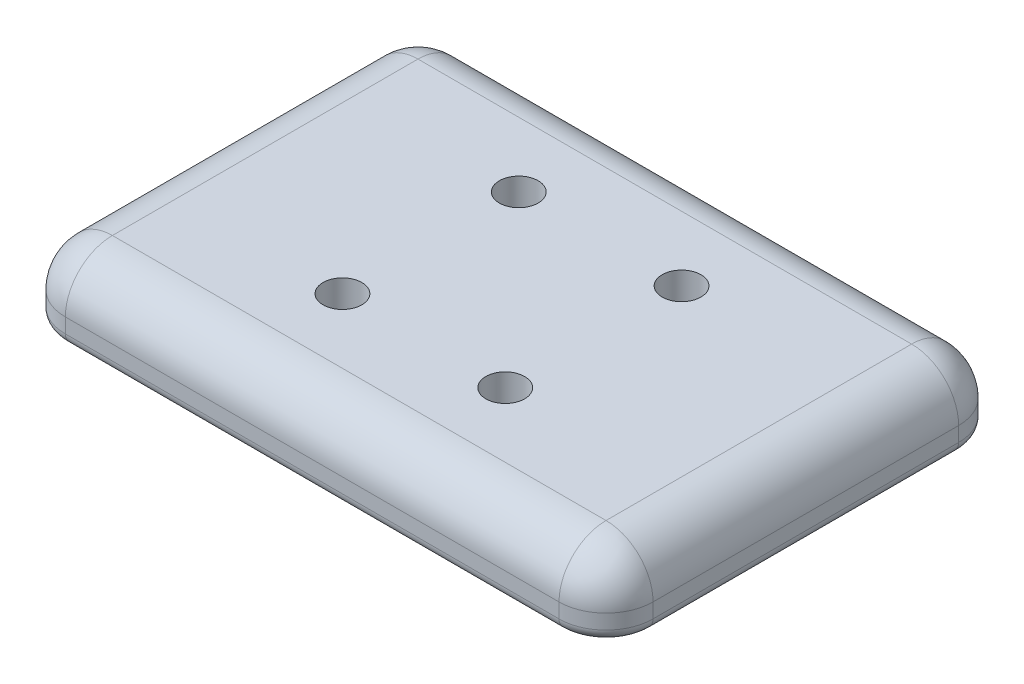
ISO-10303-21;
HEADER;
FILE_DESCRIPTION(('STEP AP214'),'2;1');
FILE_NAME('part.step','',(''),(''),'','','');
FILE_SCHEMA(('AUTOMOTIVE_DESIGN { 1 0 10303 214 1 1 1 1 }'));
ENDSEC;
DATA;
#1=APPLICATION_CONTEXT('core data for automotive mechanical design processes');
#2=APPLICATION_PROTOCOL_DEFINITION('international standard','automotive_design',2000,#1);
#3=PRODUCT_CONTEXT('',#1,'mechanical');
#4=PRODUCT('Part','Part','',(#3));
#5=PRODUCT_RELATED_PRODUCT_CATEGORY('part','',(#4));
#6=PRODUCT_DEFINITION_FORMATION('','',#4);
#7=PRODUCT_DEFINITION_CONTEXT('part definition',#1,'design');
#8=PRODUCT_DEFINITION('design','',#6,#7);
#9=PRODUCT_DEFINITION_SHAPE('','',#8);
#10=(LENGTH_UNIT() NAMED_UNIT(*) SI_UNIT(.MILLI.,.METRE.));
#11=(NAMED_UNIT(*) PLANE_ANGLE_UNIT() SI_UNIT($,.RADIAN.));
#12=(NAMED_UNIT(*) SI_UNIT($,.STERADIAN.) SOLID_ANGLE_UNIT());
#13=UNCERTAINTY_MEASURE_WITH_UNIT(LENGTH_MEASURE(1.E-05),#10,'distance_accuracy_value','');
#14=(GEOMETRIC_REPRESENTATION_CONTEXT(3) GLOBAL_UNCERTAINTY_ASSIGNED_CONTEXT((#13)) GLOBAL_UNIT_ASSIGNED_CONTEXT((#10,
#11,#12)) REPRESENTATION_CONTEXT('',''));
#15=CARTESIAN_POINT('',(0.,0.,0.));
#16=DIRECTION('',(0.,0.,1.));
#17=DIRECTION('',(1.,0.,0.));
#18=AXIS2_PLACEMENT_3D('',#15,#16,#17);
#19=CARTESIAN_POINT('',(0.,0.,68.));
#20=DIRECTION('',(0.,1.,0.));
#21=DIRECTION('',(0.,0.,1.));
#22=AXIS2_PLACEMENT_3D('',#19,#20,#21);
#23=PLANE('',#22);
#24=DIRECTION('',(1.,0.,0.));
#25=VECTOR('',#24,1.);
#26=CARTESIAN_POINT('',(0.,0.,66.));
#27=LINE('',#26,#25);
#28=CARTESIAN_POINT('',(92.,0.,66.));
#29=VERTEX_POINT('',#28);
#30=CARTESIAN_POINT('',(8.00000000000001,0.,66.));
#31=VERTEX_POINT('',#30);
#32=EDGE_CURVE('E202',#29,#31,#27,.F.);
#33=ORIENTED_EDGE('',*,*,#32,.T.);
#34=CARTESIAN_POINT('',(8.00000000000001,0.,60.));
#35=DIRECTION('',(0.,1.,0.));
#36=DIRECTION('',(0.,0.,1.));
#37=AXIS2_PLACEMENT_3D('',#34,#35,#36);
#38=CIRCLE('',#37,6.);
#39=CARTESIAN_POINT('',(2.00000000000001,0.,60.));
#40=VERTEX_POINT('',#39);
#41=EDGE_CURVE('E241',#31,#40,#38,.F.);
#42=ORIENTED_EDGE('',*,*,#41,.T.);
#43=DIRECTION('',(0.,0.,1.));
#44=VECTOR('',#43,1.);
#45=CARTESIAN_POINT('',(2.00000000000001,0.,68.));
#46=LINE('',#45,#44);
#47=CARTESIAN_POINT('',(2.,0.,8.));
#48=VERTEX_POINT('',#47);
#49=EDGE_CURVE('E239',#40,#48,#46,.F.);
#50=ORIENTED_EDGE('',*,*,#49,.T.);
#51=CARTESIAN_POINT('',(8.,0.,8.));
#52=DIRECTION('',(0.,1.,0.));
#53=DIRECTION('',(0.,0.,1.));
#54=AXIS2_PLACEMENT_3D('',#51,#52,#53);
#55=CIRCLE('',#54,6.);
#56=CARTESIAN_POINT('',(8.,0.,2.));
#57=VERTEX_POINT('',#56);
#58=EDGE_CURVE('E237',#48,#57,#55,.F.);
#59=ORIENTED_EDGE('',*,*,#58,.T.);
#60=DIRECTION('',(-1.,0.,0.));
#61=VECTOR('',#60,1.);
#62=CARTESIAN_POINT('',(0.,0.,2.));
#63=LINE('',#62,#61);
#64=CARTESIAN_POINT('',(92.,0.,2.));
#65=VERTEX_POINT('',#64);
#66=EDGE_CURVE('E235',#57,#65,#63,.F.);
#67=ORIENTED_EDGE('',*,*,#66,.T.);
#68=CARTESIAN_POINT('',(92.,0.,8.));
#69=DIRECTION('',(0.,1.,0.));
#70=DIRECTION('',(0.,0.,1.));
#71=AXIS2_PLACEMENT_3D('',#68,#69,#70);
#72=CIRCLE('',#71,6.);
#73=CARTESIAN_POINT('',(98.,0.,8.));
#74=VERTEX_POINT('',#73);
#75=EDGE_CURVE('E233',#65,#74,#72,.F.);
#76=ORIENTED_EDGE('',*,*,#75,.T.);
#77=DIRECTION('',(0.,0.,-1.));
#78=VECTOR('',#77,1.);
#79=CARTESIAN_POINT('',(98.,0.,68.));
#80=LINE('',#79,#78);
#81=CARTESIAN_POINT('',(98.,0.,60.));
#82=VERTEX_POINT('',#81);
#83=EDGE_CURVE('E231',#74,#82,#80,.F.);
#84=ORIENTED_EDGE('',*,*,#83,.T.);
#85=CARTESIAN_POINT('',(92.,0.,60.));
#86=DIRECTION('',(0.,1.,0.));
#87=DIRECTION('',(0.,0.,1.));
#88=AXIS2_PLACEMENT_3D('',#85,#86,#87);
#89=CIRCLE('',#88,6.);
#90=EDGE_CURVE('E229',#82,#29,#89,.F.);
#91=ORIENTED_EDGE('',*,*,#90,.T.);
#92=EDGE_LOOP('',(#33,#42,#50,#59,#67,#76,#84,#91));
#93=FACE_BOUND('',#92,.T.);
#94=CARTESIAN_POINT('',(36.15,0.,19.));
#95=DIRECTION('',(0.,-1.,0.));
#96=DIRECTION('',(0.,0.,-1.));
#97=AXIS2_PLACEMENT_3D('',#94,#95,#96);
#98=CIRCLE('',#97,7.2735);
#99=CARTESIAN_POINT('',(36.15,0.,11.7265));
#100=VERTEX_POINT('',#99);
#101=EDGE_CURVE('E695',#100,#100,#98,.T.);
#102=ORIENTED_EDGE('',*,*,#101,.F.);
#103=EDGE_LOOP('',(#102));
#104=FACE_BOUND('',#103,.T.);
#105=CARTESIAN_POINT('',(63.85,0.,49.));
#106=DIRECTION('',(0.,-1.,0.));
#107=DIRECTION('',(0.,0.,-1.));
#108=AXIS2_PLACEMENT_3D('',#105,#106,#107);
#109=CIRCLE('',#108,7.2735);
#110=CARTESIAN_POINT('',(63.85,0.,41.7265));
#111=VERTEX_POINT('',#110);
#112=EDGE_CURVE('E683',#111,#111,#109,.T.);
#113=ORIENTED_EDGE('',*,*,#112,.F.);
#114=EDGE_LOOP('',(#113));
#115=FACE_BOUND('',#114,.T.);
#116=CARTESIAN_POINT('',(63.85,0.,19.));
#117=DIRECTION('',(0.,-1.,0.));
#118=DIRECTION('',(0.,0.,-1.));
#119=AXIS2_PLACEMENT_3D('',#116,#117,#118);
#120=CIRCLE('',#119,7.2735);
#121=CARTESIAN_POINT('',(63.85,0.,11.7265));
#122=VERTEX_POINT('',#121);
#123=EDGE_CURVE('E669',#122,#122,#120,.T.);
#124=ORIENTED_EDGE('',*,*,#123,.F.);
#125=EDGE_LOOP('',(#124));
#126=FACE_BOUND('',#125,.T.);
#127=CARTESIAN_POINT('',(36.15,0.,49.));
#128=DIRECTION('',(0.,-1.,0.));
#129=DIRECTION('',(0.,0.,-1.));
#130=AXIS2_PLACEMENT_3D('',#127,#128,#129);
#131=CIRCLE('',#130,7.2735);
#132=CARTESIAN_POINT('',(36.15,0.,41.7265));
#133=VERTEX_POINT('',#132);
#134=EDGE_CURVE('E227',#133,#133,#131,.T.);
#135=ORIENTED_EDGE('',*,*,#134,.F.);
#136=EDGE_LOOP('',(#135));
#137=FACE_BOUND('',#136,.T.);
#138=ADVANCED_FACE('F33',(#93,#104,#115,#126,#137),#23,.F.);
#139=CARTESIAN_POINT('',(0.,12.5,0.));
#140=DIRECTION('',(1.,0.,0.));
#141=DIRECTION('',(0.,0.,-1.));
#142=AXIS2_PLACEMENT_3D('',#139,#140,#141);
#143=PLANE('',#142);
#144=DIRECTION('',(0.,-1.,0.));
#145=VECTOR('',#144,1.);
#146=CARTESIAN_POINT('',(0.,12.5,8.));
#147=LINE('',#146,#145);
#148=CARTESIAN_POINT('',(0.,4.5,8.));
#149=VERTEX_POINT('',#148);
#150=CARTESIAN_POINT('',(0.,2.,8.));
#151=VERTEX_POINT('',#150);
#152=EDGE_CURVE('E194',#149,#151,#147,.T.);
#153=ORIENTED_EDGE('',*,*,#152,.T.);
#154=DIRECTION('',(0.,0.,1.));
#155=VECTOR('',#154,1.);
#156=CARTESIAN_POINT('',(0.,2.,0.));
#157=LINE('',#156,#155);
#158=CARTESIAN_POINT('',(0.,2.,60.));
#159=VERTEX_POINT('',#158);
#160=EDGE_CURVE('E247',#151,#159,#157,.T.);
#161=ORIENTED_EDGE('',*,*,#160,.T.);
#162=DIRECTION('',(0.,-1.,0.));
#163=VECTOR('',#162,1.);
#164=CARTESIAN_POINT('',(0.,12.5,60.));
#165=LINE('',#164,#163);
#166=CARTESIAN_POINT('',(0.,4.5,60.));
#167=VERTEX_POINT('',#166);
#168=EDGE_CURVE('E192',#159,#167,#165,.F.);
#169=ORIENTED_EDGE('',*,*,#168,.T.);
#170=DIRECTION('',(0.,0.,1.));
#171=VECTOR('',#170,1.);
#172=CARTESIAN_POINT('',(0.,4.5,0.));
#173=LINE('',#172,#171);
#174=EDGE_CURVE('E190',#167,#149,#173,.F.);
#175=ORIENTED_EDGE('',*,*,#174,.T.);
#176=EDGE_LOOP('',(#153,#161,#169,#175));
#177=FACE_BOUND('',#176,.T.);
#178=ADVANCED_FACE('F315',(#177),#143,.F.);
#179=CARTESIAN_POINT('',(0.,12.5,68.));
#180=DIRECTION('',(0.,0.,-1.));
#181=DIRECTION('',(-1.,0.,0.));
#182=AXIS2_PLACEMENT_3D('',#179,#180,#181);
#183=PLANE('',#182);
#184=DIRECTION('',(0.,-1.,0.));
#185=VECTOR('',#184,1.);
#186=CARTESIAN_POINT('',(8.00000000000001,12.5,68.));
#187=LINE('',#186,#185);
#188=CARTESIAN_POINT('',(8.00000000000001,4.5,68.));
#189=VERTEX_POINT('',#188);
#190=CARTESIAN_POINT('',(8.00000000000001,2.,68.));
#191=VERTEX_POINT('',#190);
#192=EDGE_CURVE('E177',#189,#191,#187,.T.);
#193=ORIENTED_EDGE('',*,*,#192,.T.);
#194=DIRECTION('',(1.,0.,0.));
#195=VECTOR('',#194,1.);
#196=CARTESIAN_POINT('',(0.,2.,68.));
#197=LINE('',#196,#195);
#198=CARTESIAN_POINT('',(92.,2.,68.));
#199=VERTEX_POINT('',#198);
#200=EDGE_CURVE('E11',#191,#199,#197,.T.);
#201=ORIENTED_EDGE('',*,*,#200,.T.);
#202=DIRECTION('',(0.,-1.,0.));
#203=VECTOR('',#202,1.);
#204=CARTESIAN_POINT('',(92.,12.5,68.));
#205=LINE('',#204,#203);
#206=CARTESIAN_POINT('',(92.,4.5,68.));
#207=VERTEX_POINT('',#206);
#208=EDGE_CURVE('E179',#199,#207,#205,.F.);
#209=ORIENTED_EDGE('',*,*,#208,.T.);
#210=DIRECTION('',(1.,0.,0.));
#211=VECTOR('',#210,1.);
#212=CARTESIAN_POINT('',(0.,4.5,68.));
#213=LINE('',#212,#211);
#214=EDGE_CURVE('E172',#207,#189,#213,.F.);
#215=ORIENTED_EDGE('',*,*,#214,.T.);
#216=EDGE_LOOP('',(#193,#201,#209,#215));
#217=FACE_BOUND('',#216,.T.);
#218=ADVANCED_FACE('F321',(#217),#183,.F.);
#219=CARTESIAN_POINT('',(100.,12.5,0.));
#220=DIRECTION('',(-1.,0.,0.));
#221=DIRECTION('',(0.,0.,1.));
#222=AXIS2_PLACEMENT_3D('',#219,#220,#221);
#223=PLANE('',#222);
#224=DIRECTION('',(0.,-1.,0.));
#225=VECTOR('',#224,1.);
#226=CARTESIAN_POINT('',(100.,12.5,60.));
#227=LINE('',#226,#225);
#228=CARTESIAN_POINT('',(100.,4.5,60.));
#229=VERTEX_POINT('',#228);
#230=CARTESIAN_POINT('',(100.,2.,60.));
#231=VERTEX_POINT('',#230);
#232=EDGE_CURVE('E170',#229,#231,#227,.T.);
#233=ORIENTED_EDGE('',*,*,#232,.T.);
#234=DIRECTION('',(0.,0.,-1.));
#235=VECTOR('',#234,1.);
#236=CARTESIAN_POINT('',(100.,2.,0.));
#237=LINE('',#236,#235);
#238=CARTESIAN_POINT('',(100.,2.,8.));
#239=VERTEX_POINT('',#238);
#240=EDGE_CURVE('E141',#231,#239,#237,.T.);
#241=ORIENTED_EDGE('',*,*,#240,.T.);
#242=DIRECTION('',(0.,-1.,0.));
#243=VECTOR('',#242,1.);
#244=CARTESIAN_POINT('',(100.,12.5,8.));
#245=LINE('',#244,#243);
#246=CARTESIAN_POINT('',(100.,4.5,8.));
#247=VERTEX_POINT('',#246);
#248=EDGE_CURVE('E134',#239,#247,#245,.F.);
#249=ORIENTED_EDGE('',*,*,#248,.T.);
#250=DIRECTION('',(0.,0.,-1.));
#251=VECTOR('',#250,1.);
#252=CARTESIAN_POINT('',(100.,4.5,68.));
#253=LINE('',#252,#251);
#254=EDGE_CURVE('E138',#247,#229,#253,.F.);
#255=ORIENTED_EDGE('',*,*,#254,.T.);
#256=EDGE_LOOP('',(#233,#241,#249,#255));
#257=FACE_BOUND('',#256,.T.);
#258=ADVANCED_FACE('F136',(#257),#223,.F.);
#259=CARTESIAN_POINT('',(0.,12.5,0.));
#260=DIRECTION('',(0.,0.,1.));
#261=DIRECTION('',(1.,0.,0.));
#262=AXIS2_PLACEMENT_3D('',#259,#260,#261);
#263=PLANE('',#262);
#264=DIRECTION('',(0.,-1.,0.));
#265=VECTOR('',#264,1.);
#266=CARTESIAN_POINT('',(92.,12.5,0.));
#267=LINE('',#266,#265);
#268=CARTESIAN_POINT('',(92.,4.5,0.));
#269=VERTEX_POINT('',#268);
#270=CARTESIAN_POINT('',(92.,2.,0.));
#271=VERTEX_POINT('',#270);
#272=EDGE_CURVE('E152',#269,#271,#267,.T.);
#273=ORIENTED_EDGE('',*,*,#272,.T.);
#274=DIRECTION('',(-1.,0.,0.));
#275=VECTOR('',#274,1.);
#276=CARTESIAN_POINT('',(0.,2.,0.));
#277=LINE('',#276,#275);
#278=CARTESIAN_POINT('',(8.,2.,0.));
#279=VERTEX_POINT('',#278);
#280=EDGE_CURVE('E251',#271,#279,#277,.T.);
#281=ORIENTED_EDGE('',*,*,#280,.T.);
#282=DIRECTION('',(0.,-1.,0.));
#283=VECTOR('',#282,1.);
#284=CARTESIAN_POINT('',(8.,12.5,0.));
#285=LINE('',#284,#283);
#286=CARTESIAN_POINT('',(8.,4.5,0.));
#287=VERTEX_POINT('',#286);
#288=EDGE_CURVE('E200',#279,#287,#285,.F.);
#289=ORIENTED_EDGE('',*,*,#288,.T.);
#290=DIRECTION('',(-1.,0.,0.));
#291=VECTOR('',#290,1.);
#292=CARTESIAN_POINT('',(100.,4.5,0.));
#293=LINE('',#292,#291);
#294=EDGE_CURVE('E198',#287,#269,#293,.F.);
#295=ORIENTED_EDGE('',*,*,#294,.T.);
#296=EDGE_LOOP('',(#273,#281,#289,#295));
#297=FACE_BOUND('',#296,.T.);
#298=ADVANCED_FACE('F287',(#297),#263,.F.);
#299=CARTESIAN_POINT('',(0.,12.5,68.));
#300=DIRECTION('',(0.,1.,0.));
#301=DIRECTION('',(0.,0.,1.));
#302=AXIS2_PLACEMENT_3D('',#299,#300,#301);
#303=PLANE('',#302);
#304=DIRECTION('',(1.,0.,0.));
#305=VECTOR('',#304,1.);
#306=CARTESIAN_POINT('',(100.,12.5,60.));
#307=LINE('',#306,#305);
#308=CARTESIAN_POINT('',(8.00000000000001,12.5,60.));
#309=VERTEX_POINT('',#308);
#310=CARTESIAN_POINT('',(92.,12.5,60.));
#311=VERTEX_POINT('',#310);
#312=EDGE_CURVE('E183',#309,#311,#307,.T.);
#313=ORIENTED_EDGE('',*,*,#312,.T.);
#314=DIRECTION('',(0.,0.,-1.));
#315=VECTOR('',#314,1.);
#316=CARTESIAN_POINT('',(92.,12.5,0.));
#317=LINE('',#316,#315);
#318=CARTESIAN_POINT('',(92.,12.5,8.));
#319=VERTEX_POINT('',#318);
#320=EDGE_CURVE('E187',#311,#319,#317,.T.);
#321=ORIENTED_EDGE('',*,*,#320,.T.);
#322=DIRECTION('',(-1.,0.,0.));
#323=VECTOR('',#322,1.);
#324=CARTESIAN_POINT('',(0.,12.5,8.));
#325=LINE('',#324,#323);
#326=CARTESIAN_POINT('',(8.,12.5,8.));
#327=VERTEX_POINT('',#326);
#328=EDGE_CURVE('E185',#319,#327,#325,.T.);
#329=ORIENTED_EDGE('',*,*,#328,.T.);
#330=DIRECTION('',(0.,0.,1.));
#331=VECTOR('',#330,1.);
#332=CARTESIAN_POINT('',(8.00000000000001,12.5,68.));
#333=LINE('',#332,#331);
#334=EDGE_CURVE('E181',#327,#309,#333,.T.);
#335=ORIENTED_EDGE('',*,*,#334,.T.);
#336=EDGE_LOOP('',(#313,#321,#329,#335));
#337=FACE_BOUND('',#336,.T.);
#338=CARTESIAN_POINT('',(36.15,12.5,49.));
#339=DIRECTION('',(0.,-1.,0.));
#340=DIRECTION('',(0.,0.,-1.));
#341=AXIS2_PLACEMENT_3D('',#338,#339,#340);
#342=CIRCLE('',#341,3.3);
#343=CARTESIAN_POINT('',(36.15,12.5,45.7));
#344=VERTEX_POINT('',#343);
#345=EDGE_CURVE('E698',#344,#344,#342,.T.);
#346=ORIENTED_EDGE('',*,*,#345,.T.);
#347=EDGE_LOOP('',(#346));
#348=FACE_BOUND('',#347,.T.);
#349=CARTESIAN_POINT('',(36.15,12.5,19.));
#350=DIRECTION('',(0.,-1.,0.));
#351=DIRECTION('',(0.,0.,-1.));
#352=AXIS2_PLACEMENT_3D('',#349,#350,#351);
#353=CIRCLE('',#352,3.3);
#354=CARTESIAN_POINT('',(36.15,12.5,15.7));
#355=VERTEX_POINT('',#354);
#356=EDGE_CURVE('E686',#355,#355,#353,.T.);
#357=ORIENTED_EDGE('',*,*,#356,.T.);
#358=EDGE_LOOP('',(#357));
#359=FACE_BOUND('',#358,.T.);
#360=CARTESIAN_POINT('',(63.85,12.5,49.));
#361=DIRECTION('',(0.,-1.,0.));
#362=DIRECTION('',(0.,0.,-1.));
#363=AXIS2_PLACEMENT_3D('',#360,#361,#362);
#364=CIRCLE('',#363,3.3);
#365=CARTESIAN_POINT('',(63.85,12.5,45.7));
#366=VERTEX_POINT('',#365);
#367=EDGE_CURVE('E674',#366,#366,#364,.T.);
#368=ORIENTED_EDGE('',*,*,#367,.T.);
#369=EDGE_LOOP('',(#368));
#370=FACE_BOUND('',#369,.T.);
#371=CARTESIAN_POINT('',(63.85,12.5,19.));
#372=DIRECTION('',(0.,-1.,0.));
#373=DIRECTION('',(0.,0.,-1.));
#374=AXIS2_PLACEMENT_3D('',#371,#372,#373);
#375=CIRCLE('',#374,3.3);
#376=CARTESIAN_POINT('',(63.85,12.5,15.7));
#377=VERTEX_POINT('',#376);
#378=EDGE_CURVE('E144',#377,#377,#375,.T.);
#379=ORIENTED_EDGE('',*,*,#378,.T.);
#380=EDGE_LOOP('',(#379));
#381=FACE_BOUND('',#380,.T.);
#382=ADVANCED_FACE('F296',(#337,#348,#359,#370,#381),#303,.T.);
#383=CARTESIAN_POINT('',(63.85,0.,19.));
#384=DIRECTION('',(0.,-1.,0.));
#385=DIRECTION('',(0.,0.,-1.));
#386=AXIS2_PLACEMENT_3D('',#383,#384,#385);
#387=CYLINDRICAL_SURFACE('',#386,3.3);
#388=ORIENTED_EDGE('',*,*,#378,.F.);
#389=EDGE_LOOP('',(#388));
#390=FACE_BOUND('',#389,.T.);
#391=CARTESIAN_POINT('',(63.85,6.,19.));
#392=DIRECTION('',(0.,-1.,0.));
#393=DIRECTION('',(0.,0.,-1.));
#394=AXIS2_PLACEMENT_3D('',#391,#392,#393);
#395=CIRCLE('',#394,3.3);
#396=CARTESIAN_POINT('',(63.85,6.,15.7));
#397=VERTEX_POINT('',#396);
#398=EDGE_CURVE('E665',#397,#397,#395,.T.);
#399=ORIENTED_EDGE('',*,*,#398,.T.);
#400=EDGE_LOOP('',(#399));
#401=FACE_BOUND('',#400,.T.);
#402=ADVANCED_FACE('F606',(#390,#401),#387,.F.);
#403=CARTESIAN_POINT('',(67.15,6.,19.));
#404=DIRECTION('',(0.,1.,0.));
#405=DIRECTION('',(0.,0.,1.));
#406=AXIS2_PLACEMENT_3D('',#403,#404,#405);
#407=PLANE('',#406);
#408=ORIENTED_EDGE('',*,*,#398,.F.);
#409=EDGE_LOOP('',(#408));
#410=FACE_BOUND('',#409,.T.);
#411=CARTESIAN_POINT('',(63.85,6.,19.));
#412=DIRECTION('',(0.,-1.,0.));
#413=DIRECTION('',(0.,0.,-1.));
#414=AXIS2_PLACEMENT_3D('',#411,#412,#413);
#415=CIRCLE('',#414,7.2735);
#416=CARTESIAN_POINT('',(63.85,6.,11.7265));
#417=VERTEX_POINT('',#416);
#418=EDGE_CURVE('E666',#417,#417,#415,.T.);
#419=ORIENTED_EDGE('',*,*,#418,.T.);
#420=EDGE_LOOP('',(#419));
#421=FACE_BOUND('',#420,.T.);
#422=ADVANCED_FACE('F597',(#410,#421),#407,.F.);
#423=CARTESIAN_POINT('',(63.85,0.,19.));
#424=DIRECTION('',(0.,-1.,0.));
#425=DIRECTION('',(0.,0.,-1.));
#426=AXIS2_PLACEMENT_3D('',#423,#424,#425);
#427=CYLINDRICAL_SURFACE('',#426,7.2735);
#428=ORIENTED_EDGE('',*,*,#418,.F.);
#429=EDGE_LOOP('',(#428));
#430=FACE_BOUND('',#429,.T.);
#431=ORIENTED_EDGE('',*,*,#123,.T.);
#432=EDGE_LOOP('',(#431));
#433=FACE_BOUND('',#432,.T.);
#434=ADVANCED_FACE('F588',(#430,#433),#427,.F.);
#435=CARTESIAN_POINT('',(63.85,0.,49.));
#436=DIRECTION('',(0.,-1.,0.));
#437=DIRECTION('',(0.,0.,-1.));
#438=AXIS2_PLACEMENT_3D('',#435,#436,#437);
#439=CYLINDRICAL_SURFACE('',#438,3.3);
#440=ORIENTED_EDGE('',*,*,#367,.F.);
#441=EDGE_LOOP('',(#440));
#442=FACE_BOUND('',#441,.T.);
#443=CARTESIAN_POINT('',(63.85,6.,49.));
#444=DIRECTION('',(0.,-1.,0.));
#445=DIRECTION('',(0.,0.,-1.));
#446=AXIS2_PLACEMENT_3D('',#443,#444,#445);
#447=CIRCLE('',#446,3.3);
#448=CARTESIAN_POINT('',(63.85,6.,45.7));
#449=VERTEX_POINT('',#448);
#450=EDGE_CURVE('E677',#449,#449,#447,.T.);
#451=ORIENTED_EDGE('',*,*,#450,.T.);
#452=EDGE_LOOP('',(#451));
#453=FACE_BOUND('',#452,.T.);
#454=ADVANCED_FACE('F579',(#442,#453),#439,.F.);
#455=CARTESIAN_POINT('',(67.15,6.,49.));
#456=DIRECTION('',(0.,1.,0.));
#457=DIRECTION('',(0.,0.,1.));
#458=AXIS2_PLACEMENT_3D('',#455,#456,#457);
#459=PLANE('',#458);
#460=ORIENTED_EDGE('',*,*,#450,.F.);
#461=EDGE_LOOP('',(#460));
#462=FACE_BOUND('',#461,.T.);
#463=CARTESIAN_POINT('',(63.85,6.,49.));
#464=DIRECTION('',(0.,-1.,0.));
#465=DIRECTION('',(0.,0.,-1.));
#466=AXIS2_PLACEMENT_3D('',#463,#464,#465);
#467=CIRCLE('',#466,7.2735);
#468=CARTESIAN_POINT('',(63.85,6.,41.7265));
#469=VERTEX_POINT('',#468);
#470=EDGE_CURVE('E680',#469,#469,#467,.T.);
#471=ORIENTED_EDGE('',*,*,#470,.T.);
#472=EDGE_LOOP('',(#471));
#473=FACE_BOUND('',#472,.T.);
#474=ADVANCED_FACE('F570',(#462,#473),#459,.F.);
#475=CARTESIAN_POINT('',(63.85,0.,49.));
#476=DIRECTION('',(0.,-1.,0.));
#477=DIRECTION('',(0.,0.,-1.));
#478=AXIS2_PLACEMENT_3D('',#475,#476,#477);
#479=CYLINDRICAL_SURFACE('',#478,7.2735);
#480=ORIENTED_EDGE('',*,*,#470,.F.);
#481=EDGE_LOOP('',(#480));
#482=FACE_BOUND('',#481,.T.);
#483=ORIENTED_EDGE('',*,*,#112,.T.);
#484=EDGE_LOOP('',(#483));
#485=FACE_BOUND('',#484,.T.);
#486=ADVANCED_FACE('F561',(#482,#485),#479,.F.);
#487=CARTESIAN_POINT('',(36.15,0.,19.));
#488=DIRECTION('',(0.,-1.,0.));
#489=DIRECTION('',(0.,0.,-1.));
#490=AXIS2_PLACEMENT_3D('',#487,#488,#489);
#491=CYLINDRICAL_SURFACE('',#490,3.3);
#492=ORIENTED_EDGE('',*,*,#356,.F.);
#493=EDGE_LOOP('',(#492));
#494=FACE_BOUND('',#493,.T.);
#495=CARTESIAN_POINT('',(36.15,6.,19.));
#496=DIRECTION('',(0.,-1.,0.));
#497=DIRECTION('',(0.,0.,-1.));
#498=AXIS2_PLACEMENT_3D('',#495,#496,#497);
#499=CIRCLE('',#498,3.3);
#500=CARTESIAN_POINT('',(36.15,6.,15.7));
#501=VERTEX_POINT('',#500);
#502=EDGE_CURVE('E689',#501,#501,#499,.T.);
#503=ORIENTED_EDGE('',*,*,#502,.T.);
#504=EDGE_LOOP('',(#503));
#505=FACE_BOUND('',#504,.T.);
#506=ADVANCED_FACE('F552',(#494,#505),#491,.F.);
#507=CARTESIAN_POINT('',(39.45,6.,19.));
#508=DIRECTION('',(0.,1.,0.));
#509=DIRECTION('',(0.,0.,1.));
#510=AXIS2_PLACEMENT_3D('',#507,#508,#509);
#511=PLANE('',#510);
#512=ORIENTED_EDGE('',*,*,#502,.F.);
#513=EDGE_LOOP('',(#512));
#514=FACE_BOUND('',#513,.T.);
#515=CARTESIAN_POINT('',(36.15,6.,19.));
#516=DIRECTION('',(0.,-1.,0.));
#517=DIRECTION('',(0.,0.,-1.));
#518=AXIS2_PLACEMENT_3D('',#515,#516,#517);
#519=CIRCLE('',#518,7.2735);
#520=CARTESIAN_POINT('',(36.15,6.,11.7265));
#521=VERTEX_POINT('',#520);
#522=EDGE_CURVE('E692',#521,#521,#519,.T.);
#523=ORIENTED_EDGE('',*,*,#522,.T.);
#524=EDGE_LOOP('',(#523));
#525=FACE_BOUND('',#524,.T.);
#526=ADVANCED_FACE('F543',(#514,#525),#511,.F.);
#527=CARTESIAN_POINT('',(36.15,0.,19.));
#528=DIRECTION('',(0.,-1.,0.));
#529=DIRECTION('',(0.,0.,-1.));
#530=AXIS2_PLACEMENT_3D('',#527,#528,#529);
#531=CYLINDRICAL_SURFACE('',#530,7.2735);
#532=ORIENTED_EDGE('',*,*,#522,.F.);
#533=EDGE_LOOP('',(#532));
#534=FACE_BOUND('',#533,.T.);
#535=ORIENTED_EDGE('',*,*,#101,.T.);
#536=EDGE_LOOP('',(#535));
#537=FACE_BOUND('',#536,.T.);
#538=ADVANCED_FACE('F534',(#534,#537),#531,.F.);
#539=CARTESIAN_POINT('',(36.15,0.,49.));
#540=DIRECTION('',(0.,-1.,0.));
#541=DIRECTION('',(0.,0.,-1.));
#542=AXIS2_PLACEMENT_3D('',#539,#540,#541);
#543=CYLINDRICAL_SURFACE('',#542,3.3);
#544=ORIENTED_EDGE('',*,*,#345,.F.);
#545=EDGE_LOOP('',(#544));
#546=FACE_BOUND('',#545,.T.);
#547=CARTESIAN_POINT('',(36.15,6.,49.));
#548=DIRECTION('',(0.,-1.,0.));
#549=DIRECTION('',(0.,0.,-1.));
#550=AXIS2_PLACEMENT_3D('',#547,#548,#549);
#551=CIRCLE('',#550,3.3);
#552=CARTESIAN_POINT('',(36.15,6.,45.7));
#553=VERTEX_POINT('',#552);
#554=EDGE_CURVE('E701',#553,#553,#551,.T.);
#555=ORIENTED_EDGE('',*,*,#554,.T.);
#556=EDGE_LOOP('',(#555));
#557=FACE_BOUND('',#556,.T.);
#558=ADVANCED_FACE('F525',(#546,#557),#543,.F.);
#559=CARTESIAN_POINT('',(39.45,6.,49.));
#560=DIRECTION('',(0.,1.,0.));
#561=DIRECTION('',(0.,0.,1.));
#562=AXIS2_PLACEMENT_3D('',#559,#560,#561);
#563=PLANE('',#562);
#564=ORIENTED_EDGE('',*,*,#554,.F.);
#565=EDGE_LOOP('',(#564));
#566=FACE_BOUND('',#565,.T.);
#567=CARTESIAN_POINT('',(36.15,6.,49.));
#568=DIRECTION('',(0.,-1.,0.));
#569=DIRECTION('',(0.,0.,-1.));
#570=AXIS2_PLACEMENT_3D('',#567,#568,#569);
#571=CIRCLE('',#570,7.2735);
#572=CARTESIAN_POINT('',(36.15,6.,41.7265));
#573=VERTEX_POINT('',#572);
#574=EDGE_CURVE('E704',#573,#573,#571,.T.);
#575=ORIENTED_EDGE('',*,*,#574,.T.);
#576=EDGE_LOOP('',(#575));
#577=FACE_BOUND('',#576,.T.);
#578=ADVANCED_FACE('F516',(#566,#577),#563,.F.);
#579=CARTESIAN_POINT('',(36.15,0.,49.));
#580=DIRECTION('',(0.,-1.,0.));
#581=DIRECTION('',(0.,0.,-1.));
#582=AXIS2_PLACEMENT_3D('',#579,#580,#581);
#583=CYLINDRICAL_SURFACE('',#582,7.2735);
#584=ORIENTED_EDGE('',*,*,#574,.F.);
#585=EDGE_LOOP('',(#584));
#586=FACE_BOUND('',#585,.T.);
#587=ORIENTED_EDGE('',*,*,#134,.T.);
#588=EDGE_LOOP('',(#587));
#589=FACE_BOUND('',#588,.T.);
#590=ADVANCED_FACE('F362',(#586,#589),#583,.F.);
#591=CARTESIAN_POINT('',(8.,12.5,8.));
#592=DIRECTION('',(0.,-1.,0.));
#593=DIRECTION('',(0.,0.,-1.));
#594=AXIS2_PLACEMENT_3D('',#591,#592,#593);
#595=CYLINDRICAL_SURFACE('',#594,8.);
#596=ORIENTED_EDGE('',*,*,#288,.F.);
#597=CARTESIAN_POINT('',(8.,2.,8.));
#598=DIRECTION('',(0.,1.,0.));
#599=DIRECTION('',(0.,0.,1.));
#600=AXIS2_PLACEMENT_3D('',#597,#598,#599);
#601=CIRCLE('',#600,8.);
#602=EDGE_CURVE('E249',#279,#151,#601,.T.);
#603=ORIENTED_EDGE('',*,*,#602,.T.);
#604=ORIENTED_EDGE('',*,*,#152,.F.);
#605=CARTESIAN_POINT('',(8.,4.5,8.));
#606=DIRECTION('',(0.,1.,0.));
#607=DIRECTION('',(0.,0.,1.));
#608=AXIS2_PLACEMENT_3D('',#605,#606,#607);
#609=CIRCLE('',#608,8.);
#610=EDGE_CURVE('E224',#287,#149,#609,.T.);
#611=ORIENTED_EDGE('',*,*,#610,.F.);
#612=EDGE_LOOP('',(#596,#603,#604,#611));
#613=FACE_BOUND('',#612,.T.);
#614=ADVANCED_FACE('F351',(#613),#595,.T.);
#615=CARTESIAN_POINT('',(8.,4.5,8.));
#616=DIRECTION('',(0.,0.,1.));
#617=DIRECTION('',(1.,0.,0.));
#618=AXIS2_PLACEMENT_3D('',#615,#616,#617);
#619=SPHERICAL_SURFACE('',#618,8.);
#620=CARTESIAN_POINT('',(8.,4.5,8.));
#621=DIRECTION('',(-1.,0.,0.));
#622=DIRECTION('',(0.,0.,1.));
#623=AXIS2_PLACEMENT_3D('',#620,#621,#622);
#624=CIRCLE('',#623,8.);
#625=EDGE_CURVE('E218',#287,#327,#624,.F.);
#626=ORIENTED_EDGE('',*,*,#625,.F.);
#627=ORIENTED_EDGE('',*,*,#610,.T.);
#628=CARTESIAN_POINT('',(8.,4.5,8.));
#629=DIRECTION('',(0.,0.,-1.));
#630=DIRECTION('',(-1.,0.,0.));
#631=AXIS2_PLACEMENT_3D('',#628,#629,#630);
#632=CIRCLE('',#631,8.);
#633=EDGE_CURVE('E221',#327,#149,#632,.F.);
#634=ORIENTED_EDGE('',*,*,#633,.F.);
#635=EDGE_LOOP('',(#626,#627,#634));
#636=FACE_BOUND('',#635,.T.);
#637=ADVANCED_FACE('F354',(#636),#619,.T.);
#638=CARTESIAN_POINT('',(8.00000000000001,12.5,60.));
#639=DIRECTION('',(0.,-1.,0.));
#640=DIRECTION('',(0.,0.,-1.));
#641=AXIS2_PLACEMENT_3D('',#638,#639,#640);
#642=CYLINDRICAL_SURFACE('',#641,8.);
#643=ORIENTED_EDGE('',*,*,#168,.F.);
#644=CARTESIAN_POINT('',(8.00000000000001,2.,60.));
#645=DIRECTION('',(0.,1.,0.));
#646=DIRECTION('',(0.,0.,1.));
#647=AXIS2_PLACEMENT_3D('',#644,#645,#646);
#648=CIRCLE('',#647,8.);
#649=EDGE_CURVE('E244',#159,#191,#648,.T.);
#650=ORIENTED_EDGE('',*,*,#649,.T.);
#651=ORIENTED_EDGE('',*,*,#192,.F.);
#652=CARTESIAN_POINT('',(8.00000000000001,4.5,60.));
#653=DIRECTION('',(0.,1.,0.));
#654=DIRECTION('',(0.,0.,1.));
#655=AXIS2_PLACEMENT_3D('',#652,#653,#654);
#656=CIRCLE('',#655,8.);
#657=EDGE_CURVE('E215',#167,#189,#656,.T.);
#658=ORIENTED_EDGE('',*,*,#657,.F.);
#659=EDGE_LOOP('',(#643,#650,#651,#658));
#660=FACE_BOUND('',#659,.T.);
#661=ADVANCED_FACE('F338',(#660),#642,.T.);
#662=CARTESIAN_POINT('',(8.00000000000001,4.5,68.));
#663=DIRECTION('',(0.,0.,-1.));
#664=DIRECTION('',(-1.,0.,0.));
#665=AXIS2_PLACEMENT_3D('',#662,#663,#664);
#666=CYLINDRICAL_SURFACE('',#665,8.);
#667=ORIENTED_EDGE('',*,*,#633,.T.);
#668=ORIENTED_EDGE('',*,*,#174,.F.);
#669=CARTESIAN_POINT('',(8.00000000000001,4.5,60.));
#670=DIRECTION('',(0.,0.,1.));
#671=DIRECTION('',(1.,0.,0.));
#672=AXIS2_PLACEMENT_3D('',#669,#670,#671);
#673=CIRCLE('',#672,8.);
#674=EDGE_CURVE('E212',#309,#167,#673,.T.);
#675=ORIENTED_EDGE('',*,*,#674,.F.);
#676=ORIENTED_EDGE('',*,*,#334,.F.);
#677=EDGE_LOOP('',(#667,#668,#675,#676));
#678=FACE_BOUND('',#677,.T.);
#679=ADVANCED_FACE('F347',(#678),#666,.T.);
#680=CARTESIAN_POINT('',(0.,4.5,8.));
#681=DIRECTION('',(1.,0.,0.));
#682=DIRECTION('',(0.,0.,-1.));
#683=AXIS2_PLACEMENT_3D('',#680,#681,#682);
#684=CYLINDRICAL_SURFACE('',#683,8.);
#685=ORIENTED_EDGE('',*,*,#625,.T.);
#686=ORIENTED_EDGE('',*,*,#328,.F.);
#687=CARTESIAN_POINT('',(92.,4.5,8.));
#688=DIRECTION('',(1.,0.,0.));
#689=DIRECTION('',(0.,0.,-1.));
#690=AXIS2_PLACEMENT_3D('',#687,#688,#689);
#691=CIRCLE('',#690,8.);
#692=EDGE_CURVE('E156',#269,#319,#691,.T.);
#693=ORIENTED_EDGE('',*,*,#692,.F.);
#694=ORIENTED_EDGE('',*,*,#294,.F.);
#695=EDGE_LOOP('',(#685,#686,#693,#694));
#696=FACE_BOUND('',#695,.T.);
#697=ADVANCED_FACE('F292',(#696),#684,.T.);
#698=CARTESIAN_POINT('',(92.,12.5,8.));
#699=DIRECTION('',(0.,-1.,0.));
#700=DIRECTION('',(0.,0.,-1.));
#701=AXIS2_PLACEMENT_3D('',#698,#699,#700);
#702=CYLINDRICAL_SURFACE('',#701,8.);
#703=ORIENTED_EDGE('',*,*,#248,.F.);
#704=CARTESIAN_POINT('',(92.,2.,8.));
#705=DIRECTION('',(0.,1.,0.));
#706=DIRECTION('',(0.,0.,1.));
#707=AXIS2_PLACEMENT_3D('',#704,#705,#706);
#708=CIRCLE('',#707,8.);
#709=EDGE_CURVE('E253',#239,#271,#708,.T.);
#710=ORIENTED_EDGE('',*,*,#709,.T.);
#711=ORIENTED_EDGE('',*,*,#272,.F.);
#712=CARTESIAN_POINT('',(92.,4.5,8.));
#713=DIRECTION('',(0.,1.,0.));
#714=DIRECTION('',(0.,0.,1.));
#715=AXIS2_PLACEMENT_3D('',#712,#713,#714);
#716=CIRCLE('',#715,8.);
#717=EDGE_CURVE('E148',#247,#269,#716,.T.);
#718=ORIENTED_EDGE('',*,*,#717,.F.);
#719=EDGE_LOOP('',(#703,#710,#711,#718));
#720=FACE_BOUND('',#719,.T.);
#721=ADVANCED_FACE('F150',(#720),#702,.T.);
#722=CARTESIAN_POINT('',(8.00000000000001,4.5,60.));
#723=DIRECTION('',(0.,0.,1.));
#724=DIRECTION('',(1.,0.,0.));
#725=AXIS2_PLACEMENT_3D('',#722,#723,#724);
#726=SPHERICAL_SURFACE('',#725,8.);
#727=ORIENTED_EDGE('',*,*,#674,.T.);
#728=ORIENTED_EDGE('',*,*,#657,.T.);
#729=CARTESIAN_POINT('',(8.00000000000001,4.5,60.));
#730=DIRECTION('',(-1.,0.,0.));
#731=DIRECTION('',(0.,0.,1.));
#732=AXIS2_PLACEMENT_3D('',#729,#730,#731);
#733=CIRCLE('',#732,8.);
#734=EDGE_CURVE('E157',#309,#189,#733,.F.);
#735=ORIENTED_EDGE('',*,*,#734,.F.);
#736=EDGE_LOOP('',(#727,#728,#735));
#737=FACE_BOUND('',#736,.T.);
#738=ADVANCED_FACE('F342',(#737),#726,.T.);
#739=CARTESIAN_POINT('',(92.,4.5,8.));
#740=DIRECTION('',(0.,0.,1.));
#741=DIRECTION('',(1.,0.,0.));
#742=AXIS2_PLACEMENT_3D('',#739,#740,#741);
#743=SPHERICAL_SURFACE('',#742,8.);
#744=ORIENTED_EDGE('',*,*,#717,.T.);
#745=ORIENTED_EDGE('',*,*,#692,.T.);
#746=CARTESIAN_POINT('',(92.,4.5,8.));
#747=DIRECTION('',(0.,0.,-1.));
#748=DIRECTION('',(-1.,0.,0.));
#749=AXIS2_PLACEMENT_3D('',#746,#747,#748);
#750=CIRCLE('',#749,8.);
#751=EDGE_CURVE('E159',#247,#319,#750,.F.);
#752=ORIENTED_EDGE('',*,*,#751,.F.);
#753=EDGE_LOOP('',(#744,#745,#752));
#754=FACE_BOUND('',#753,.T.);
#755=ADVANCED_FACE('F160',(#754),#743,.T.);
#756=CARTESIAN_POINT('',(0.,4.5,60.));
#757=DIRECTION('',(-1.,0.,0.));
#758=DIRECTION('',(0.,0.,1.));
#759=AXIS2_PLACEMENT_3D('',#756,#757,#758);
#760=CYLINDRICAL_SURFACE('',#759,8.);
#761=ORIENTED_EDGE('',*,*,#734,.T.);
#762=ORIENTED_EDGE('',*,*,#214,.F.);
#763=CARTESIAN_POINT('',(92.,4.5,60.));
#764=DIRECTION('',(1.,0.,0.));
#765=DIRECTION('',(0.,0.,-1.));
#766=AXIS2_PLACEMENT_3D('',#763,#764,#765);
#767=CIRCLE('',#766,8.);
#768=EDGE_CURVE('E164',#311,#207,#767,.T.);
#769=ORIENTED_EDGE('',*,*,#768,.F.);
#770=ORIENTED_EDGE('',*,*,#312,.F.);
#771=EDGE_LOOP('',(#761,#762,#769,#770));
#772=FACE_BOUND('',#771,.T.);
#773=ADVANCED_FACE('F302',(#772),#760,.T.);
#774=CARTESIAN_POINT('',(92.,4.5,68.));
#775=DIRECTION('',(0.,0.,1.));
#776=DIRECTION('',(1.,0.,0.));
#777=AXIS2_PLACEMENT_3D('',#774,#775,#776);
#778=CYLINDRICAL_SURFACE('',#777,8.);
#779=ORIENTED_EDGE('',*,*,#751,.T.);
#780=ORIENTED_EDGE('',*,*,#320,.F.);
#781=CARTESIAN_POINT('',(92.,4.5,60.));
#782=DIRECTION('',(0.,0.,1.));
#783=DIRECTION('',(1.,0.,0.));
#784=AXIS2_PLACEMENT_3D('',#781,#782,#783);
#785=CIRCLE('',#784,8.);
#786=EDGE_CURVE('E168',#229,#311,#785,.T.);
#787=ORIENTED_EDGE('',*,*,#786,.F.);
#788=ORIENTED_EDGE('',*,*,#254,.F.);
#789=EDGE_LOOP('',(#779,#780,#787,#788));
#790=FACE_BOUND('',#789,.T.);
#791=ADVANCED_FACE('F166',(#790),#778,.T.);
#792=CARTESIAN_POINT('',(92.,4.5,60.));
#793=DIRECTION('',(0.,0.,1.));
#794=DIRECTION('',(1.,0.,0.));
#795=AXIS2_PLACEMENT_3D('',#792,#793,#794);
#796=SPHERICAL_SURFACE('',#795,8.);
#797=ORIENTED_EDGE('',*,*,#786,.T.);
#798=ORIENTED_EDGE('',*,*,#768,.T.);
#799=CARTESIAN_POINT('',(92.,4.5,60.));
#800=DIRECTION('',(0.,1.,0.));
#801=DIRECTION('',(0.,0.,1.));
#802=AXIS2_PLACEMENT_3D('',#799,#800,#801);
#803=CIRCLE('',#802,8.);
#804=EDGE_CURVE('E203',#229,#207,#803,.F.);
#805=ORIENTED_EDGE('',*,*,#804,.F.);
#806=EDGE_LOOP('',(#797,#798,#805));
#807=FACE_BOUND('',#806,.T.);
#808=ADVANCED_FACE('F304',(#807),#796,.T.);
#809=CARTESIAN_POINT('',(92.,12.5,60.));
#810=DIRECTION('',(0.,-1.,0.));
#811=DIRECTION('',(0.,0.,-1.));
#812=AXIS2_PLACEMENT_3D('',#809,#810,#811);
#813=CYLINDRICAL_SURFACE('',#812,8.);
#814=ORIENTED_EDGE('',*,*,#208,.F.);
#815=CARTESIAN_POINT('',(92.,2.,60.));
#816=DIRECTION('',(0.,1.,0.));
#817=DIRECTION('',(0.,0.,1.));
#818=AXIS2_PLACEMENT_3D('',#815,#816,#817);
#819=CIRCLE('',#818,8.);
#820=EDGE_CURVE('E42',#199,#231,#819,.T.);
#821=ORIENTED_EDGE('',*,*,#820,.T.);
#822=ORIENTED_EDGE('',*,*,#232,.F.);
#823=ORIENTED_EDGE('',*,*,#804,.T.);
#824=EDGE_LOOP('',(#814,#821,#822,#823));
#825=FACE_BOUND('',#824,.T.);
#826=ADVANCED_FACE('F305',(#825),#813,.T.);
#827=CARTESIAN_POINT('',(92.,2.,8.));
#828=DIRECTION('',(0.,1.,0.));
#829=DIRECTION('',(0.,0.,1.));
#830=AXIS2_PLACEMENT_3D('',#827,#828,#829);
#831=TOROIDAL_SURFACE('',#830,6.,2.);
#832=CARTESIAN_POINT('',(92.,2.,2.));
#833=DIRECTION('',(-1.,0.,0.));
#834=DIRECTION('',(0.,0.,1.));
#835=AXIS2_PLACEMENT_3D('',#832,#833,#834);
#836=CIRCLE('',#835,2.);
#837=EDGE_CURVE('E272',#271,#65,#836,.T.);
#838=ORIENTED_EDGE('',*,*,#837,.F.);
#839=ORIENTED_EDGE('',*,*,#709,.F.);
#840=CARTESIAN_POINT('',(98.,2.,8.));
#841=DIRECTION('',(0.,0.,1.));
#842=DIRECTION('',(1.,0.,0.));
#843=AXIS2_PLACEMENT_3D('',#840,#841,#842);
#844=CIRCLE('',#843,2.);
#845=EDGE_CURVE('E37',#74,#239,#844,.T.);
#846=ORIENTED_EDGE('',*,*,#845,.F.);
#847=ORIENTED_EDGE('',*,*,#75,.F.);
#848=EDGE_LOOP('',(#838,#839,#846,#847));
#849=FACE_BOUND('',#848,.T.);
#850=ADVANCED_FACE('F35',(#849),#831,.T.);
#851=CARTESIAN_POINT('',(98.,2.,0.));
#852=DIRECTION('',(0.,0.,-1.));
#853=DIRECTION('',(-1.,0.,0.));
#854=AXIS2_PLACEMENT_3D('',#851,#852,#853);
#855=CYLINDRICAL_SURFACE('',#854,2.);
#856=ORIENTED_EDGE('',*,*,#845,.T.);
#857=ORIENTED_EDGE('',*,*,#240,.F.);
#858=CARTESIAN_POINT('',(98.,2.,60.));
#859=DIRECTION('',(0.,0.,1.));
#860=DIRECTION('',(1.,0.,0.));
#861=AXIS2_PLACEMENT_3D('',#858,#859,#860);
#862=CIRCLE('',#861,2.);
#863=EDGE_CURVE('E270',#82,#231,#862,.T.);
#864=ORIENTED_EDGE('',*,*,#863,.F.);
#865=ORIENTED_EDGE('',*,*,#83,.F.);
#866=EDGE_LOOP('',(#856,#857,#864,#865));
#867=FACE_BOUND('',#866,.T.);
#868=ADVANCED_FACE('F282',(#867),#855,.T.);
#869=CARTESIAN_POINT('',(0.,2.,2.));
#870=DIRECTION('',(-1.,0.,0.));
#871=DIRECTION('',(0.,0.,1.));
#872=AXIS2_PLACEMENT_3D('',#869,#870,#871);
#873=CYLINDRICAL_SURFACE('',#872,2.);
#874=ORIENTED_EDGE('',*,*,#837,.T.);
#875=ORIENTED_EDGE('',*,*,#66,.F.);
#876=CARTESIAN_POINT('',(8.,2.,2.));
#877=DIRECTION('',(-1.,0.,0.));
#878=DIRECTION('',(0.,0.,1.));
#879=AXIS2_PLACEMENT_3D('',#876,#877,#878);
#880=CIRCLE('',#879,2.);
#881=EDGE_CURVE('E267',#279,#57,#880,.T.);
#882=ORIENTED_EDGE('',*,*,#881,.F.);
#883=ORIENTED_EDGE('',*,*,#280,.F.);
#884=EDGE_LOOP('',(#874,#875,#882,#883));
#885=FACE_BOUND('',#884,.T.);
#886=ADVANCED_FACE('F385',(#885),#873,.T.);
#887=CARTESIAN_POINT('',(92.,2.,60.));
#888=DIRECTION('',(0.,1.,0.));
#889=DIRECTION('',(0.,0.,1.));
#890=AXIS2_PLACEMENT_3D('',#887,#888,#889);
#891=TOROIDAL_SURFACE('',#890,6.,2.);
#892=ORIENTED_EDGE('',*,*,#863,.T.);
#893=ORIENTED_EDGE('',*,*,#820,.F.);
#894=CARTESIAN_POINT('',(92.,2.,66.));
#895=DIRECTION('',(-1.,0.,0.));
#896=DIRECTION('',(0.,0.,1.));
#897=AXIS2_PLACEMENT_3D('',#894,#895,#896);
#898=CIRCLE('',#897,2.);
#899=EDGE_CURVE('E264',#29,#199,#898,.T.);
#900=ORIENTED_EDGE('',*,*,#899,.F.);
#901=ORIENTED_EDGE('',*,*,#90,.F.);
#902=EDGE_LOOP('',(#892,#893,#900,#901));
#903=FACE_BOUND('',#902,.T.);
#904=ADVANCED_FACE('F381',(#903),#891,.T.);
#905=CARTESIAN_POINT('',(8.,2.,8.));
#906=DIRECTION('',(0.,1.,0.));
#907=DIRECTION('',(0.,0.,1.));
#908=AXIS2_PLACEMENT_3D('',#905,#906,#907);
#909=TOROIDAL_SURFACE('',#908,6.,2.);
#910=ORIENTED_EDGE('',*,*,#881,.T.);
#911=ORIENTED_EDGE('',*,*,#58,.F.);
#912=CARTESIAN_POINT('',(2.,2.,8.));
#913=DIRECTION('',(0.,0.,1.));
#914=DIRECTION('',(1.,0.,0.));
#915=AXIS2_PLACEMENT_3D('',#912,#913,#914);
#916=CIRCLE('',#915,2.);
#917=EDGE_CURVE('E261',#151,#48,#916,.T.);
#918=ORIENTED_EDGE('',*,*,#917,.F.);
#919=ORIENTED_EDGE('',*,*,#602,.F.);
#920=EDGE_LOOP('',(#910,#911,#918,#919));
#921=FACE_BOUND('',#920,.T.);
#922=ADVANCED_FACE('F377',(#921),#909,.T.);
#923=CARTESIAN_POINT('',(0.,2.,66.));
#924=DIRECTION('',(1.,0.,0.));
#925=DIRECTION('',(0.,0.,-1.));
#926=AXIS2_PLACEMENT_3D('',#923,#924,#925);
#927=CYLINDRICAL_SURFACE('',#926,2.);
#928=ORIENTED_EDGE('',*,*,#899,.T.);
#929=ORIENTED_EDGE('',*,*,#200,.F.);
#930=CARTESIAN_POINT('',(8.00000000000001,2.,66.));
#931=DIRECTION('',(-1.,0.,0.));
#932=DIRECTION('',(0.,0.,1.));
#933=AXIS2_PLACEMENT_3D('',#930,#931,#932);
#934=CIRCLE('',#933,2.);
#935=EDGE_CURVE('E259',#31,#191,#934,.T.);
#936=ORIENTED_EDGE('',*,*,#935,.F.);
#937=ORIENTED_EDGE('',*,*,#32,.F.);
#938=EDGE_LOOP('',(#928,#929,#936,#937));
#939=FACE_BOUND('',#938,.T.);
#940=ADVANCED_FACE('F373',(#939),#927,.T.);
#941=CARTESIAN_POINT('',(2.,2.,0.));
#942=DIRECTION('',(0.,0.,1.));
#943=DIRECTION('',(1.,0.,0.));
#944=AXIS2_PLACEMENT_3D('',#941,#942,#943);
#945=CYLINDRICAL_SURFACE('',#944,2.);
#946=ORIENTED_EDGE('',*,*,#917,.T.);
#947=ORIENTED_EDGE('',*,*,#49,.F.);
#948=CARTESIAN_POINT('',(2.00000000000001,2.,60.));
#949=DIRECTION('',(0.,0.,1.));
#950=DIRECTION('',(1.,0.,0.));
#951=AXIS2_PLACEMENT_3D('',#948,#949,#950);
#952=CIRCLE('',#951,2.);
#953=EDGE_CURVE('E257',#159,#40,#952,.T.);
#954=ORIENTED_EDGE('',*,*,#953,.F.);
#955=ORIENTED_EDGE('',*,*,#160,.F.);
#956=EDGE_LOOP('',(#946,#947,#954,#955));
#957=FACE_BOUND('',#956,.T.);
#958=ADVANCED_FACE('F369',(#957),#945,.T.);
#959=CARTESIAN_POINT('',(8.00000000000001,2.,60.));
#960=DIRECTION('',(0.,1.,0.));
#961=DIRECTION('',(0.,0.,1.));
#962=AXIS2_PLACEMENT_3D('',#959,#960,#961);
#963=TOROIDAL_SURFACE('',#962,6.,2.);
#964=ORIENTED_EDGE('',*,*,#935,.T.);
#965=ORIENTED_EDGE('',*,*,#649,.F.);
#966=ORIENTED_EDGE('',*,*,#953,.T.);
#967=ORIENTED_EDGE('',*,*,#41,.F.);
#968=EDGE_LOOP('',(#964,#965,#966,#967));
#969=FACE_BOUND('',#968,.T.);
#970=ADVANCED_FACE('F366',(#969),#963,.T.);
#971=CLOSED_SHELL('',(#138,#178,#218,#258,#298,#382,#402,#422,#434,#454,#474,#486,#506,#526,
#538,#558,#578,#590,#614,#637,#661,#679,#697,#721,#738,#755,#773,#791,#808,#826,#850,#868,#886,
#904,#922,#940,#958,#970));
#972=MANIFOLD_SOLID_BREP('B2',#971);
#973=ADVANCED_BREP_SHAPE_REPRESENTATION('',(#18,#972),#14);
#974=SHAPE_DEFINITION_REPRESENTATION(#9,#973);
ENDSEC;
END-ISO-10303-21;
